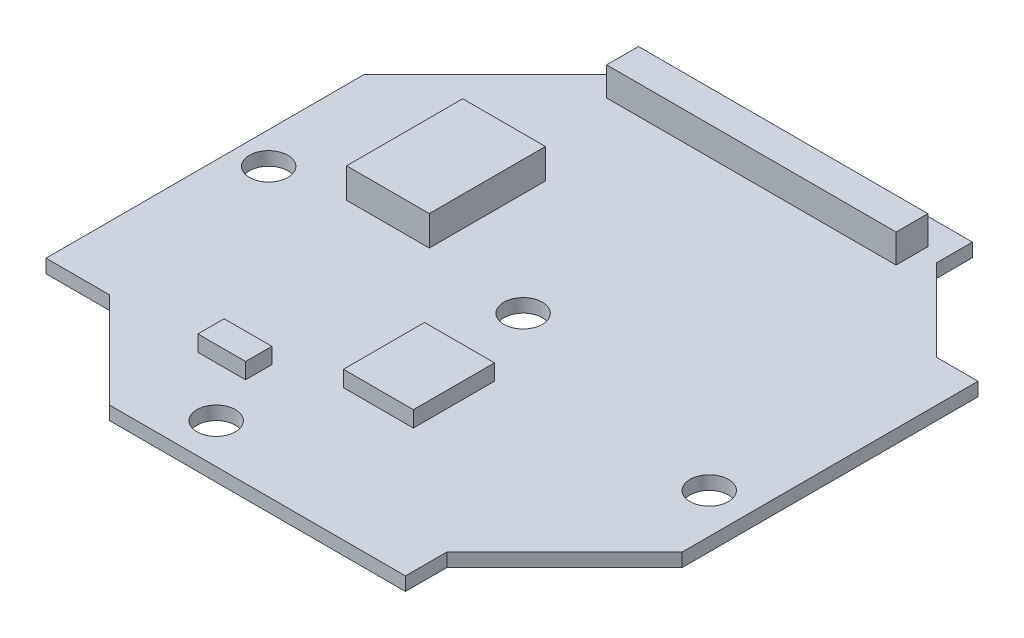
ISO-10303-21;
HEADER;
FILE_DESCRIPTION(('STEP AP214'),'2;1');
FILE_NAME('part.step','',(''),(''),'','','');
FILE_SCHEMA(('AUTOMOTIVE_DESIGN { 1 0 10303 214 1 1 1 1 }'));
ENDSEC;
DATA;
#1=APPLICATION_CONTEXT('core data for automotive mechanical design processes');
#2=APPLICATION_PROTOCOL_DEFINITION('international standard','automotive_design',2000,#1);
#3=PRODUCT_CONTEXT('',#1,'mechanical');
#4=PRODUCT('Part','Part','',(#3));
#5=PRODUCT_RELATED_PRODUCT_CATEGORY('part','',(#4));
#6=PRODUCT_DEFINITION_FORMATION('','',#4);
#7=PRODUCT_DEFINITION_CONTEXT('part definition',#1,'design');
#8=PRODUCT_DEFINITION('design','',#6,#7);
#9=PRODUCT_DEFINITION_SHAPE('','',#8);
#10=(LENGTH_UNIT() NAMED_UNIT(*) SI_UNIT(.MILLI.,.METRE.));
#11=(NAMED_UNIT(*) PLANE_ANGLE_UNIT() SI_UNIT($,.RADIAN.));
#12=(NAMED_UNIT(*) SI_UNIT($,.STERADIAN.) SOLID_ANGLE_UNIT());
#13=UNCERTAINTY_MEASURE_WITH_UNIT(LENGTH_MEASURE(1.E-05),#10,'distance_accuracy_value','');
#14=(GEOMETRIC_REPRESENTATION_CONTEXT(3) GLOBAL_UNCERTAINTY_ASSIGNED_CONTEXT((#13)) GLOBAL_UNIT_ASSIGNED_CONTEXT((#10,
#11,#12)) REPRESENTATION_CONTEXT('',''));
#15=CARTESIAN_POINT('',(0.,0.,0.));
#16=DIRECTION('',(0.,0.,1.));
#17=DIRECTION('',(1.,0.,0.));
#18=AXIS2_PLACEMENT_3D('',#15,#16,#17);
#19=CARTESIAN_POINT('',(-10.25,0.85,-18.));
#20=DIRECTION('',(0.,-1.,0.));
#21=DIRECTION('',(0.,0.,-1.));
#22=AXIS2_PLACEMENT_3D('',#19,#20,#21);
#23=PLANE('',#22);
#24=CARTESIAN_POINT('',(15.5,0.85,3.8));
#25=DIRECTION('',(0.,1.,0.));
#26=DIRECTION('',(0.,0.,1.));
#27=AXIS2_PLACEMENT_3D('',#24,#25,#26);
#28=CIRCLE('',#27,1.21);
#29=CARTESIAN_POINT('',(15.5,0.85,5.01));
#30=VERTEX_POINT('',#29);
#31=EDGE_CURVE('E860',#30,#30,#28,.T.);
#32=ORIENTED_EDGE('',*,*,#31,.F.);
#33=EDGE_LOOP('',(#32));
#34=FACE_BOUND('',#33,.T.);
#35=CARTESIAN_POINT('',(-3.8,0.85,15.5));
#36=DIRECTION('',(0.,1.,0.));
#37=DIRECTION('',(0.,0.,1.));
#38=AXIS2_PLACEMENT_3D('',#35,#36,#37);
#39=CIRCLE('',#38,1.21);
#40=CARTESIAN_POINT('',(-3.8,0.85,16.71));
#41=VERTEX_POINT('',#40);
#42=EDGE_CURVE('E862',#41,#41,#39,.T.);
#43=ORIENTED_EDGE('',*,*,#42,.F.);
#44=EDGE_LOOP('',(#43));
#45=FACE_BOUND('',#44,.T.);
#46=CARTESIAN_POINT('',(-16.,0.85,0.));
#47=DIRECTION('',(0.,1.,0.));
#48=DIRECTION('',(0.,0.,1.));
#49=AXIS2_PLACEMENT_3D('',#46,#47,#48);
#50=CIRCLE('',#49,1.21);
#51=CARTESIAN_POINT('',(-16.,0.85,1.21));
#52=VERTEX_POINT('',#51);
#53=EDGE_CURVE('E868',#52,#52,#50,.T.);
#54=ORIENTED_EDGE('',*,*,#53,.F.);
#55=EDGE_LOOP('',(#54));
#56=FACE_BOUND('',#55,.T.);
#57=CARTESIAN_POINT('',(0.,0.85,0.));
#58=DIRECTION('',(0.,1.,0.));
#59=DIRECTION('',(0.,0.,1.));
#60=AXIS2_PLACEMENT_3D('',#57,#58,#59);
#61=CIRCLE('',#60,1.21);
#62=CARTESIAN_POINT('',(0.,0.85,1.21));
#63=VERTEX_POINT('',#62);
#64=EDGE_CURVE('E874',#63,#63,#61,.T.);
#65=ORIENTED_EDGE('',*,*,#64,.F.);
#66=EDGE_LOOP('',(#65));
#67=FACE_BOUND('',#66,.T.);
#68=DIRECTION('',(0.,0.,1.));
#69=VECTOR('',#68,1.);
#70=CARTESIAN_POINT('',(-1.6,0.85,4.6));
#71=LINE('',#70,#69);
#72=CARTESIAN_POINT('',(-1.6,0.85,4.6));
#73=VERTEX_POINT('',#72);
#74=CARTESIAN_POINT('',(-1.6,0.85,9.7));
#75=VERTEX_POINT('',#74);
#76=EDGE_CURVE('E242',#73,#75,#71,.T.);
#77=ORIENTED_EDGE('',*,*,#76,.F.);
#78=DIRECTION('',(-1.,0.,0.));
#79=VECTOR('',#78,1.);
#80=CARTESIAN_POINT('',(-1.6,0.85,4.6));
#81=LINE('',#80,#79);
#82=CARTESIAN_POINT('',(2.8,0.85,4.6));
#83=VERTEX_POINT('',#82);
#84=EDGE_CURVE('E255',#83,#73,#81,.T.);
#85=ORIENTED_EDGE('',*,*,#84,.F.);
#86=DIRECTION('',(0.,0.,-1.));
#87=VECTOR('',#86,1.);
#88=CARTESIAN_POINT('',(2.8,0.85,4.6));
#89=LINE('',#88,#87);
#90=CARTESIAN_POINT('',(2.8,0.85,9.7));
#91=VERTEX_POINT('',#90);
#92=EDGE_CURVE('E264',#91,#83,#89,.T.);
#93=ORIENTED_EDGE('',*,*,#92,.F.);
#94=DIRECTION('',(1.,0.,0.));
#95=VECTOR('',#94,1.);
#96=CARTESIAN_POINT('',(-1.6,0.85,9.7));
#97=LINE('',#96,#95);
#98=EDGE_CURVE('E245',#75,#91,#97,.T.);
#99=ORIENTED_EDGE('',*,*,#98,.F.);
#100=EDGE_LOOP('',(#77,#85,#93,#99));
#101=FACE_BOUND('',#100,.T.);
#102=DIRECTION('',(0.,0.,1.));
#103=VECTOR('',#102,1.);
#104=CARTESIAN_POINT('',(-9.1,0.85,-16.35));
#105=LINE('',#104,#103);
#106=CARTESIAN_POINT('',(-9.1,0.85,-16.35));
#107=VERTEX_POINT('',#106);
#108=CARTESIAN_POINT('',(-9.1,0.85,-14.35));
#109=VERTEX_POINT('',#108);
#110=EDGE_CURVE('E313',#107,#109,#105,.T.);
#111=ORIENTED_EDGE('',*,*,#110,.F.);
#112=DIRECTION('',(-1.,0.,0.));
#113=VECTOR('',#112,1.);
#114=CARTESIAN_POINT('',(-9.1,0.85,-16.35));
#115=LINE('',#114,#113);
#116=CARTESIAN_POINT('',(9.1,0.85,-16.35));
#117=VERTEX_POINT('',#116);
#118=EDGE_CURVE('E318',#117,#107,#115,.T.);
#119=ORIENTED_EDGE('',*,*,#118,.F.);
#120=DIRECTION('',(0.,0.,-1.));
#121=VECTOR('',#120,1.);
#122=CARTESIAN_POINT('',(9.1,0.85,-16.35));
#123=LINE('',#122,#121);
#124=CARTESIAN_POINT('',(9.1,0.85,-14.35));
#125=VERTEX_POINT('',#124);
#126=EDGE_CURVE('E330',#125,#117,#123,.T.);
#127=ORIENTED_EDGE('',*,*,#126,.F.);
#128=DIRECTION('',(1.,0.,0.));
#129=VECTOR('',#128,1.);
#130=CARTESIAN_POINT('',(-9.1,0.85,-14.35));
#131=LINE('',#130,#129);
#132=EDGE_CURVE('E327',#109,#125,#131,.T.);
#133=ORIENTED_EDGE('',*,*,#132,.F.);
#134=EDGE_LOOP('',(#111,#119,#127,#133));
#135=FACE_BOUND('',#134,.T.);
#136=DIRECTION('',(0.,0.,1.));
#137=VECTOR('',#136,1.);
#138=CARTESIAN_POINT('',(-10.25,0.85,-15.75));
#139=LINE('',#138,#137);
#140=CARTESIAN_POINT('',(-10.25,0.85,-18.));
#141=VERTEX_POINT('',#140);
#142=CARTESIAN_POINT('',(-10.25,0.85,-15.75));
#143=VERTEX_POINT('',#142);
#144=EDGE_CURVE('E347',#141,#143,#139,.T.);
#145=ORIENTED_EDGE('',*,*,#144,.T.);
#146=DIRECTION('',(-0.707106781186546,0.,0.707106781186549));
#147=VECTOR('',#146,1.);
#148=CARTESIAN_POINT('',(-18.,0.85,-7.99999999999997));
#149=LINE('',#148,#147);
#150=CARTESIAN_POINT('',(-18.,0.85,-7.99999999999997));
#151=VERTEX_POINT('',#150);
#152=EDGE_CURVE('E350',#143,#151,#149,.T.);
#153=ORIENTED_EDGE('',*,*,#152,.T.);
#154=DIRECTION('',(0.,0.,1.));
#155=VECTOR('',#154,1.);
#156=CARTESIAN_POINT('',(-18.,0.85,12.));
#157=LINE('',#156,#155);
#158=CARTESIAN_POINT('',(-18.,0.85,12.));
#159=VERTEX_POINT('',#158);
#160=EDGE_CURVE('E353',#151,#159,#157,.T.);
#161=ORIENTED_EDGE('',*,*,#160,.T.);
#162=DIRECTION('',(1.,0.,0.));
#163=VECTOR('',#162,1.);
#164=CARTESIAN_POINT('',(-14.,0.85,12.));
#165=LINE('',#164,#163);
#166=CARTESIAN_POINT('',(-14.,0.85,12.));
#167=VERTEX_POINT('',#166);
#168=EDGE_CURVE('E355',#159,#167,#165,.T.);
#169=ORIENTED_EDGE('',*,*,#168,.T.);
#170=DIRECTION('',(0.707106781186549,0.,0.707106781186546));
#171=VECTOR('',#170,1.);
#172=CARTESIAN_POINT('',(-7.99999999999997,0.85,18.));
#173=LINE('',#172,#171);
#174=CARTESIAN_POINT('',(-7.99999999999997,0.85,18.));
#175=VERTEX_POINT('',#174);
#176=EDGE_CURVE('E357',#167,#175,#173,.T.);
#177=ORIENTED_EDGE('',*,*,#176,.T.);
#178=DIRECTION('',(1.,0.,0.));
#179=VECTOR('',#178,1.);
#180=CARTESIAN_POINT('',(10.6,0.85,18.));
#181=LINE('',#180,#179);
#182=CARTESIAN_POINT('',(10.6,0.85,18.));
#183=VERTEX_POINT('',#182);
#184=EDGE_CURVE('E359',#175,#183,#181,.T.);
#185=ORIENTED_EDGE('',*,*,#184,.T.);
#186=DIRECTION('',(0.,0.,-1.));
#187=VECTOR('',#186,1.);
#188=CARTESIAN_POINT('',(10.6,0.85,15.4));
#189=LINE('',#188,#187);
#190=CARTESIAN_POINT('',(10.6,0.85,15.4));
#191=VERTEX_POINT('',#190);
#192=EDGE_CURVE('E361',#183,#191,#189,.T.);
#193=ORIENTED_EDGE('',*,*,#192,.T.);
#194=DIRECTION('',(0.707106781186546,0.,-0.707106781186549));
#195=VECTOR('',#194,1.);
#196=CARTESIAN_POINT('',(18.,0.85,7.99999999999997));
#197=LINE('',#196,#195);
#198=CARTESIAN_POINT('',(18.,0.85,7.99999999999997));
#199=VERTEX_POINT('',#198);
#200=EDGE_CURVE('E363',#191,#199,#197,.T.);
#201=ORIENTED_EDGE('',*,*,#200,.T.);
#202=DIRECTION('',(0.,0.,-1.));
#203=VECTOR('',#202,1.);
#204=CARTESIAN_POINT('',(18.,0.85,-10.6));
#205=LINE('',#204,#203);
#206=CARTESIAN_POINT('',(18.,0.85,-10.6));
#207=VERTEX_POINT('',#206);
#208=EDGE_CURVE('E365',#199,#207,#205,.T.);
#209=ORIENTED_EDGE('',*,*,#208,.T.);
#210=DIRECTION('',(-1.,0.,0.));
#211=VECTOR('',#210,1.);
#212=CARTESIAN_POINT('',(15.4,0.85,-10.6));
#213=LINE('',#212,#211);
#214=CARTESIAN_POINT('',(15.4,0.85,-10.6));
#215=VERTEX_POINT('',#214);
#216=EDGE_CURVE('E367',#207,#215,#213,.T.);
#217=ORIENTED_EDGE('',*,*,#216,.T.);
#218=DIRECTION('',(-0.707106781186549,0.,-0.707106781186546));
#219=VECTOR('',#218,1.);
#220=CARTESIAN_POINT('',(10.25,0.85,-15.75));
#221=LINE('',#220,#219);
#222=CARTESIAN_POINT('',(10.25,0.85,-15.75));
#223=VERTEX_POINT('',#222);
#224=EDGE_CURVE('E369',#215,#223,#221,.T.);
#225=ORIENTED_EDGE('',*,*,#224,.T.);
#226=DIRECTION('',(0.,0.,-1.));
#227=VECTOR('',#226,1.);
#228=CARTESIAN_POINT('',(10.25,0.85,-18.));
#229=LINE('',#228,#227);
#230=CARTESIAN_POINT('',(10.25,0.85,-18.));
#231=VERTEX_POINT('',#230);
#232=EDGE_CURVE('E371',#223,#231,#229,.T.);
#233=ORIENTED_EDGE('',*,*,#232,.T.);
#234=DIRECTION('',(-1.,0.,0.));
#235=VECTOR('',#234,1.);
#236=CARTESIAN_POINT('',(-10.25,0.85,-18.));
#237=LINE('',#236,#235);
#238=EDGE_CURVE('E373',#231,#141,#237,.T.);
#239=ORIENTED_EDGE('',*,*,#238,.T.);
#240=EDGE_LOOP('',(#145,#153,#161,#169,#177,#185,#193,#201,#209,#217,#225,#233,#239));
#241=FACE_BOUND('',#240,.T.);
#242=DIRECTION('',(0.,0.,1.));
#243=VECTOR('',#242,1.);
#244=CARTESIAN_POINT('',(-11.7,0.85,-7.9));
#245=LINE('',#244,#243);
#246=CARTESIAN_POINT('',(-11.7,0.85,-7.9));
#247=VERTEX_POINT('',#246);
#248=CARTESIAN_POINT('',(-11.7,0.85,-0.6));
#249=VERTEX_POINT('',#248);
#250=EDGE_CURVE('E280',#247,#249,#245,.T.);
#251=ORIENTED_EDGE('',*,*,#250,.F.);
#252=DIRECTION('',(-1.,0.,0.));
#253=VECTOR('',#252,1.);
#254=CARTESIAN_POINT('',(-11.7,0.85,-7.9));
#255=LINE('',#254,#253);
#256=CARTESIAN_POINT('',(-6.5,0.85,-7.9));
#257=VERTEX_POINT('',#256);
#258=EDGE_CURVE('E285',#257,#247,#255,.T.);
#259=ORIENTED_EDGE('',*,*,#258,.F.);
#260=DIRECTION('',(0.,0.,-1.));
#261=VECTOR('',#260,1.);
#262=CARTESIAN_POINT('',(-6.5,0.85,-7.9));
#263=LINE('',#262,#261);
#264=CARTESIAN_POINT('',(-6.5,0.85,-0.6));
#265=VERTEX_POINT('',#264);
#266=EDGE_CURVE('E297',#265,#257,#263,.T.);
#267=ORIENTED_EDGE('',*,*,#266,.F.);
#268=DIRECTION('',(1.,0.,0.));
#269=VECTOR('',#268,1.);
#270=CARTESIAN_POINT('',(-11.7,0.85,-0.6));
#271=LINE('',#270,#269);
#272=EDGE_CURVE('E294',#249,#265,#271,.T.);
#273=ORIENTED_EDGE('',*,*,#272,.F.);
#274=EDGE_LOOP('',(#251,#259,#267,#273));
#275=FACE_BOUND('',#274,.T.);
#276=DIRECTION('',(0.,0.,-1.));
#277=VECTOR('',#276,1.);
#278=CARTESIAN_POINT('',(-5.1,0.85,12.35));
#279=LINE('',#278,#277);
#280=CARTESIAN_POINT('',(-5.1,0.85,12.35));
#281=VERTEX_POINT('',#280);
#282=CARTESIAN_POINT('',(-5.1,0.85,10.7));
#283=VERTEX_POINT('',#282);
#284=EDGE_CURVE('E241',#281,#283,#279,.T.);
#285=ORIENTED_EDGE('',*,*,#284,.F.);
#286=DIRECTION('',(1.,0.,0.));
#287=VECTOR('',#286,1.);
#288=CARTESIAN_POINT('',(-5.1,0.85,12.35));
#289=LINE('',#288,#287);
#290=CARTESIAN_POINT('',(-8.1,0.85,12.35));
#291=VERTEX_POINT('',#290);
#292=EDGE_CURVE('E238',#291,#281,#289,.T.);
#293=ORIENTED_EDGE('',*,*,#292,.F.);
#294=DIRECTION('',(0.,0.,1.));
#295=VECTOR('',#294,1.);
#296=CARTESIAN_POINT('',(-8.1,0.85,12.35));
#297=LINE('',#296,#295);
#298=CARTESIAN_POINT('',(-8.1,0.85,10.7));
#299=VERTEX_POINT('',#298);
#300=EDGE_CURVE('E50',#299,#291,#297,.T.);
#301=ORIENTED_EDGE('',*,*,#300,.F.);
#302=DIRECTION('',(-1.,0.,0.));
#303=VECTOR('',#302,1.);
#304=CARTESIAN_POINT('',(-5.1,0.85,10.7));
#305=LINE('',#304,#303);
#306=EDGE_CURVE('E45',#283,#299,#305,.T.);
#307=ORIENTED_EDGE('',*,*,#306,.F.);
#308=EDGE_LOOP('',(#285,#293,#301,#307));
#309=FACE_BOUND('',#308,.T.);
#310=ADVANCED_FACE('F30',(#34,#45,#56,#67,#101,#135,#241,#275,#309),#23,.F.);
#311=CARTESIAN_POINT('',(-10.25,0.85,-15.75));
#312=DIRECTION('',(1.,0.,0.));
#313=DIRECTION('',(0.,0.,-1.));
#314=AXIS2_PLACEMENT_3D('',#311,#312,#313);
#315=PLANE('',#314);
#316=DIRECTION('',(0.,0.,1.));
#317=VECTOR('',#316,1.);
#318=CARTESIAN_POINT('',(-10.25,0.,-15.75));
#319=LINE('',#318,#317);
#320=CARTESIAN_POINT('',(-10.25,0.,-18.));
#321=VERTEX_POINT('',#320);
#322=CARTESIAN_POINT('',(-10.25,0.,-15.75));
#323=VERTEX_POINT('',#322);
#324=EDGE_CURVE('E346',#321,#323,#319,.T.);
#325=ORIENTED_EDGE('',*,*,#324,.T.);
#326=DIRECTION('',(0.,-1.,0.));
#327=VECTOR('',#326,1.);
#328=CARTESIAN_POINT('',(-10.25,0.85,-15.75));
#329=LINE('',#328,#327);
#330=EDGE_CURVE('E11',#143,#323,#329,.T.);
#331=ORIENTED_EDGE('',*,*,#330,.F.);
#332=ORIENTED_EDGE('',*,*,#144,.F.);
#333=DIRECTION('',(0.,-1.,0.));
#334=VECTOR('',#333,1.);
#335=CARTESIAN_POINT('',(-10.25,0.85,-18.));
#336=LINE('',#335,#334);
#337=EDGE_CURVE('E375',#141,#321,#336,.T.);
#338=ORIENTED_EDGE('',*,*,#337,.T.);
#339=EDGE_LOOP('',(#325,#331,#332,#338));
#340=FACE_BOUND('',#339,.T.);
#341=ADVANCED_FACE('F32',(#340),#315,.F.);
#342=CARTESIAN_POINT('',(-18.,0.85,-7.99999999999997));
#343=DIRECTION('',(0.707106781186549,0.,0.707106781186546));
#344=DIRECTION('',(0.707106781186546,0.,-0.707106781186549));
#345=AXIS2_PLACEMENT_3D('',#342,#343,#344);
#346=PLANE('',#345);
#347=DIRECTION('',(-0.707106781186546,0.,0.707106781186549));
#348=VECTOR('',#347,1.);
#349=CARTESIAN_POINT('',(-18.,0.,-7.99999999999997));
#350=LINE('',#349,#348);
#351=CARTESIAN_POINT('',(-18.,0.,-7.99999999999997));
#352=VERTEX_POINT('',#351);
#353=EDGE_CURVE('E378',#323,#352,#350,.T.);
#354=ORIENTED_EDGE('',*,*,#353,.T.);
#355=DIRECTION('',(0.,-1.,0.));
#356=VECTOR('',#355,1.);
#357=CARTESIAN_POINT('',(-18.,0.85,-7.99999999999997));
#358=LINE('',#357,#356);
#359=EDGE_CURVE('E38',#151,#352,#358,.T.);
#360=ORIENTED_EDGE('',*,*,#359,.F.);
#361=ORIENTED_EDGE('',*,*,#152,.F.);
#362=ORIENTED_EDGE('',*,*,#330,.T.);
#363=EDGE_LOOP('',(#354,#360,#361,#362));
#364=FACE_BOUND('',#363,.T.);
#365=ADVANCED_FACE('F460',(#364),#346,.F.);
#366=CARTESIAN_POINT('',(-18.,0.85,12.));
#367=DIRECTION('',(1.,0.,0.));
#368=DIRECTION('',(0.,0.,-1.));
#369=AXIS2_PLACEMENT_3D('',#366,#367,#368);
#370=PLANE('',#369);
#371=DIRECTION('',(0.,0.,1.));
#372=VECTOR('',#371,1.);
#373=CARTESIAN_POINT('',(-18.,0.,12.));
#374=LINE('',#373,#372);
#375=CARTESIAN_POINT('',(-18.,0.,12.));
#376=VERTEX_POINT('',#375);
#377=EDGE_CURVE('E380',#352,#376,#374,.T.);
#378=ORIENTED_EDGE('',*,*,#377,.T.);
#379=DIRECTION('',(0.,-1.,0.));
#380=VECTOR('',#379,1.);
#381=CARTESIAN_POINT('',(-18.,0.85,12.));
#382=LINE('',#381,#380);
#383=EDGE_CURVE('E430',#159,#376,#382,.T.);
#384=ORIENTED_EDGE('',*,*,#383,.F.);
#385=ORIENTED_EDGE('',*,*,#160,.F.);
#386=ORIENTED_EDGE('',*,*,#359,.T.);
#387=EDGE_LOOP('',(#378,#384,#385,#386));
#388=FACE_BOUND('',#387,.T.);
#389=ADVANCED_FACE('F437',(#388),#370,.F.);
#390=CARTESIAN_POINT('',(-14.,0.85,12.));
#391=DIRECTION('',(0.,0.,-1.));
#392=DIRECTION('',(-1.,0.,0.));
#393=AXIS2_PLACEMENT_3D('',#390,#391,#392);
#394=PLANE('',#393);
#395=DIRECTION('',(1.,0.,0.));
#396=VECTOR('',#395,1.);
#397=CARTESIAN_POINT('',(-14.,0.,12.));
#398=LINE('',#397,#396);
#399=CARTESIAN_POINT('',(-14.,0.,12.));
#400=VERTEX_POINT('',#399);
#401=EDGE_CURVE('E382',#376,#400,#398,.T.);
#402=ORIENTED_EDGE('',*,*,#401,.T.);
#403=DIRECTION('',(0.,-1.,0.));
#404=VECTOR('',#403,1.);
#405=CARTESIAN_POINT('',(-14.,0.85,12.));
#406=LINE('',#405,#404);
#407=EDGE_CURVE('E427',#167,#400,#406,.T.);
#408=ORIENTED_EDGE('',*,*,#407,.F.);
#409=ORIENTED_EDGE('',*,*,#168,.F.);
#410=ORIENTED_EDGE('',*,*,#383,.T.);
#411=EDGE_LOOP('',(#402,#408,#409,#410));
#412=FACE_BOUND('',#411,.T.);
#413=ADVANCED_FACE('F448',(#412),#394,.F.);
#414=CARTESIAN_POINT('',(-7.99999999999997,0.85,18.));
#415=DIRECTION('',(0.707106781186546,0.,-0.707106781186549));
#416=DIRECTION('',(-0.707106781186549,0.,-0.707106781186546));
#417=AXIS2_PLACEMENT_3D('',#414,#415,#416);
#418=PLANE('',#417);
#419=DIRECTION('',(0.707106781186549,0.,0.707106781186546));
#420=VECTOR('',#419,1.);
#421=CARTESIAN_POINT('',(-7.99999999999997,0.,18.));
#422=LINE('',#421,#420);
#423=CARTESIAN_POINT('',(-7.99999999999997,0.,18.));
#424=VERTEX_POINT('',#423);
#425=EDGE_CURVE('E384',#400,#424,#422,.T.);
#426=ORIENTED_EDGE('',*,*,#425,.T.);
#427=DIRECTION('',(0.,-1.,0.));
#428=VECTOR('',#427,1.);
#429=CARTESIAN_POINT('',(-7.99999999999997,0.85,18.));
#430=LINE('',#429,#428);
#431=EDGE_CURVE('E424',#175,#424,#430,.T.);
#432=ORIENTED_EDGE('',*,*,#431,.F.);
#433=ORIENTED_EDGE('',*,*,#176,.F.);
#434=ORIENTED_EDGE('',*,*,#407,.T.);
#435=EDGE_LOOP('',(#426,#432,#433,#434));
#436=FACE_BOUND('',#435,.T.);
#437=ADVANCED_FACE('F452',(#436),#418,.F.);
#438=CARTESIAN_POINT('',(10.6,0.85,18.));
#439=DIRECTION('',(0.,0.,-1.));
#440=DIRECTION('',(-1.,0.,0.));
#441=AXIS2_PLACEMENT_3D('',#438,#439,#440);
#442=PLANE('',#441);
#443=DIRECTION('',(1.,0.,0.));
#444=VECTOR('',#443,1.);
#445=CARTESIAN_POINT('',(10.6,0.,18.));
#446=LINE('',#445,#444);
#447=CARTESIAN_POINT('',(10.6,0.,18.));
#448=VERTEX_POINT('',#447);
#449=EDGE_CURVE('E386',#424,#448,#446,.T.);
#450=ORIENTED_EDGE('',*,*,#449,.T.);
#451=DIRECTION('',(0.,-1.,0.));
#452=VECTOR('',#451,1.);
#453=CARTESIAN_POINT('',(10.6,0.85,18.));
#454=LINE('',#453,#452);
#455=EDGE_CURVE('E421',#183,#448,#454,.T.);
#456=ORIENTED_EDGE('',*,*,#455,.F.);
#457=ORIENTED_EDGE('',*,*,#184,.F.);
#458=ORIENTED_EDGE('',*,*,#431,.T.);
#459=EDGE_LOOP('',(#450,#456,#457,#458));
#460=FACE_BOUND('',#459,.T.);
#461=ADVANCED_FACE('F498',(#460),#442,.F.);
#462=CARTESIAN_POINT('',(10.6,0.85,15.4));
#463=DIRECTION('',(-1.,0.,0.));
#464=DIRECTION('',(0.,0.,1.));
#465=AXIS2_PLACEMENT_3D('',#462,#463,#464);
#466=PLANE('',#465);
#467=DIRECTION('',(0.,0.,-1.));
#468=VECTOR('',#467,1.);
#469=CARTESIAN_POINT('',(10.6,0.,15.4));
#470=LINE('',#469,#468);
#471=CARTESIAN_POINT('',(10.6,0.,15.4));
#472=VERTEX_POINT('',#471);
#473=EDGE_CURVE('E388',#448,#472,#470,.T.);
#474=ORIENTED_EDGE('',*,*,#473,.T.);
#475=DIRECTION('',(0.,-1.,0.));
#476=VECTOR('',#475,1.);
#477=CARTESIAN_POINT('',(10.6,0.85,15.4));
#478=LINE('',#477,#476);
#479=EDGE_CURVE('E418',#191,#472,#478,.T.);
#480=ORIENTED_EDGE('',*,*,#479,.F.);
#481=ORIENTED_EDGE('',*,*,#192,.F.);
#482=ORIENTED_EDGE('',*,*,#455,.T.);
#483=EDGE_LOOP('',(#474,#480,#481,#482));
#484=FACE_BOUND('',#483,.T.);
#485=ADVANCED_FACE('F495',(#484),#466,.F.);
#486=CARTESIAN_POINT('',(18.,0.85,7.99999999999997));
#487=DIRECTION('',(-0.707106781186549,0.,-0.707106781186546));
#488=DIRECTION('',(-0.707106781186546,0.,0.707106781186549));
#489=AXIS2_PLACEMENT_3D('',#486,#487,#488);
#490=PLANE('',#489);
#491=DIRECTION('',(0.707106781186546,0.,-0.707106781186549));
#492=VECTOR('',#491,1.);
#493=CARTESIAN_POINT('',(18.,0.,7.99999999999997));
#494=LINE('',#493,#492);
#495=CARTESIAN_POINT('',(18.,0.,7.99999999999997));
#496=VERTEX_POINT('',#495);
#497=EDGE_CURVE('E390',#472,#496,#494,.T.);
#498=ORIENTED_EDGE('',*,*,#497,.T.);
#499=DIRECTION('',(0.,-1.,0.));
#500=VECTOR('',#499,1.);
#501=CARTESIAN_POINT('',(18.,0.85,7.99999999999997));
#502=LINE('',#501,#500);
#503=EDGE_CURVE('E415',#199,#496,#502,.T.);
#504=ORIENTED_EDGE('',*,*,#503,.F.);
#505=ORIENTED_EDGE('',*,*,#200,.F.);
#506=ORIENTED_EDGE('',*,*,#479,.T.);
#507=EDGE_LOOP('',(#498,#504,#505,#506));
#508=FACE_BOUND('',#507,.T.);
#509=ADVANCED_FACE('F491',(#508),#490,.F.);
#510=CARTESIAN_POINT('',(18.,0.85,-10.6));
#511=DIRECTION('',(-1.,0.,0.));
#512=DIRECTION('',(0.,0.,1.));
#513=AXIS2_PLACEMENT_3D('',#510,#511,#512);
#514=PLANE('',#513);
#515=DIRECTION('',(0.,0.,-1.));
#516=VECTOR('',#515,1.);
#517=CARTESIAN_POINT('',(18.,0.,-10.6));
#518=LINE('',#517,#516);
#519=CARTESIAN_POINT('',(18.,0.,-10.6));
#520=VERTEX_POINT('',#519);
#521=EDGE_CURVE('E392',#496,#520,#518,.T.);
#522=ORIENTED_EDGE('',*,*,#521,.T.);
#523=DIRECTION('',(0.,-1.,0.));
#524=VECTOR('',#523,1.);
#525=CARTESIAN_POINT('',(18.,0.85,-10.6));
#526=LINE('',#525,#524);
#527=EDGE_CURVE('E412',#207,#520,#526,.T.);
#528=ORIENTED_EDGE('',*,*,#527,.F.);
#529=ORIENTED_EDGE('',*,*,#208,.F.);
#530=ORIENTED_EDGE('',*,*,#503,.T.);
#531=EDGE_LOOP('',(#522,#528,#529,#530));
#532=FACE_BOUND('',#531,.T.);
#533=ADVANCED_FACE('F487',(#532),#514,.F.);
#534=CARTESIAN_POINT('',(15.4,0.85,-10.6));
#535=DIRECTION('',(0.,0.,1.));
#536=DIRECTION('',(1.,0.,0.));
#537=AXIS2_PLACEMENT_3D('',#534,#535,#536);
#538=PLANE('',#537);
#539=DIRECTION('',(-1.,0.,0.));
#540=VECTOR('',#539,1.);
#541=CARTESIAN_POINT('',(15.4,0.,-10.6));
#542=LINE('',#541,#540);
#543=CARTESIAN_POINT('',(15.4,0.,-10.6));
#544=VERTEX_POINT('',#543);
#545=EDGE_CURVE('E394',#520,#544,#542,.T.);
#546=ORIENTED_EDGE('',*,*,#545,.T.);
#547=DIRECTION('',(0.,-1.,0.));
#548=VECTOR('',#547,1.);
#549=CARTESIAN_POINT('',(15.4,0.85,-10.6));
#550=LINE('',#549,#548);
#551=EDGE_CURVE('E409',#215,#544,#550,.T.);
#552=ORIENTED_EDGE('',*,*,#551,.F.);
#553=ORIENTED_EDGE('',*,*,#216,.F.);
#554=ORIENTED_EDGE('',*,*,#527,.T.);
#555=EDGE_LOOP('',(#546,#552,#553,#554));
#556=FACE_BOUND('',#555,.T.);
#557=ADVANCED_FACE('F482',(#556),#538,.F.);
#558=CARTESIAN_POINT('',(10.25,0.85,-15.75));
#559=DIRECTION('',(-0.707106781186546,0.,0.707106781186549));
#560=DIRECTION('',(0.707106781186549,0.,0.707106781186546));
#561=AXIS2_PLACEMENT_3D('',#558,#559,#560);
#562=PLANE('',#561);
#563=DIRECTION('',(-0.707106781186549,0.,-0.707106781186546));
#564=VECTOR('',#563,1.);
#565=CARTESIAN_POINT('',(10.25,0.,-15.75));
#566=LINE('',#565,#564);
#567=CARTESIAN_POINT('',(10.25,0.,-15.75));
#568=VERTEX_POINT('',#567);
#569=EDGE_CURVE('E396',#544,#568,#566,.T.);
#570=ORIENTED_EDGE('',*,*,#569,.T.);
#571=DIRECTION('',(0.,-1.,0.));
#572=VECTOR('',#571,1.);
#573=CARTESIAN_POINT('',(10.25,0.85,-15.75));
#574=LINE('',#573,#572);
#575=EDGE_CURVE('E406',#223,#568,#574,.T.);
#576=ORIENTED_EDGE('',*,*,#575,.F.);
#577=ORIENTED_EDGE('',*,*,#224,.F.);
#578=ORIENTED_EDGE('',*,*,#551,.T.);
#579=EDGE_LOOP('',(#570,#576,#577,#578));
#580=FACE_BOUND('',#579,.T.);
#581=ADVANCED_FACE('F476',(#580),#562,.F.);
#582=CARTESIAN_POINT('',(10.25,0.85,-18.));
#583=DIRECTION('',(-1.,0.,0.));
#584=DIRECTION('',(0.,0.,1.));
#585=AXIS2_PLACEMENT_3D('',#582,#583,#584);
#586=PLANE('',#585);
#587=DIRECTION('',(0.,0.,-1.));
#588=VECTOR('',#587,1.);
#589=CARTESIAN_POINT('',(10.25,0.,-18.));
#590=LINE('',#589,#588);
#591=CARTESIAN_POINT('',(10.25,0.,-18.));
#592=VERTEX_POINT('',#591);
#593=EDGE_CURVE('E398',#568,#592,#590,.T.);
#594=ORIENTED_EDGE('',*,*,#593,.T.);
#595=DIRECTION('',(0.,-1.,0.));
#596=VECTOR('',#595,1.);
#597=CARTESIAN_POINT('',(10.25,0.85,-18.));
#598=LINE('',#597,#596);
#599=EDGE_CURVE('E403',#231,#592,#598,.T.);
#600=ORIENTED_EDGE('',*,*,#599,.F.);
#601=ORIENTED_EDGE('',*,*,#232,.F.);
#602=ORIENTED_EDGE('',*,*,#575,.T.);
#603=EDGE_LOOP('',(#594,#600,#601,#602));
#604=FACE_BOUND('',#603,.T.);
#605=ADVANCED_FACE('F472',(#604),#586,.F.);
#606=CARTESIAN_POINT('',(-10.25,0.85,-18.));
#607=DIRECTION('',(0.,0.,1.));
#608=DIRECTION('',(1.,0.,0.));
#609=AXIS2_PLACEMENT_3D('',#606,#607,#608);
#610=PLANE('',#609);
#611=DIRECTION('',(-1.,0.,0.));
#612=VECTOR('',#611,1.);
#613=CARTESIAN_POINT('',(-10.25,0.,-18.));
#614=LINE('',#613,#612);
#615=EDGE_CURVE('E351',#592,#321,#614,.T.);
#616=ORIENTED_EDGE('',*,*,#615,.T.);
#617=ORIENTED_EDGE('',*,*,#337,.F.);
#618=ORIENTED_EDGE('',*,*,#238,.F.);
#619=ORIENTED_EDGE('',*,*,#599,.T.);
#620=EDGE_LOOP('',(#616,#617,#618,#619));
#621=FACE_BOUND('',#620,.T.);
#622=ADVANCED_FACE('F467',(#621),#610,.F.);
#623=CARTESIAN_POINT('',(-10.25,0.,-18.));
#624=DIRECTION('',(0.,-1.,0.));
#625=DIRECTION('',(0.,0.,-1.));
#626=AXIS2_PLACEMENT_3D('',#623,#624,#625);
#627=PLANE('',#626);
#628=CARTESIAN_POINT('',(15.5,0.,3.8));
#629=DIRECTION('',(0.,1.,0.));
#630=DIRECTION('',(0.,0.,1.));
#631=AXIS2_PLACEMENT_3D('',#628,#629,#630);
#632=CIRCLE('',#631,1.21);
#633=CARTESIAN_POINT('',(15.5,0.,5.01));
#634=VERTEX_POINT('',#633);
#635=EDGE_CURVE('E858',#634,#634,#632,.T.);
#636=ORIENTED_EDGE('',*,*,#635,.T.);
#637=EDGE_LOOP('',(#636));
#638=FACE_BOUND('',#637,.T.);
#639=CARTESIAN_POINT('',(-3.8,0.,15.5));
#640=DIRECTION('',(0.,1.,0.));
#641=DIRECTION('',(0.,0.,1.));
#642=AXIS2_PLACEMENT_3D('',#639,#640,#641);
#643=CIRCLE('',#642,1.21);
#644=CARTESIAN_POINT('',(-3.8,0.,16.71));
#645=VERTEX_POINT('',#644);
#646=EDGE_CURVE('E865',#645,#645,#643,.T.);
#647=ORIENTED_EDGE('',*,*,#646,.T.);
#648=EDGE_LOOP('',(#647));
#649=FACE_BOUND('',#648,.T.);
#650=CARTESIAN_POINT('',(-16.,0.,0.));
#651=DIRECTION('',(0.,1.,0.));
#652=DIRECTION('',(0.,0.,1.));
#653=AXIS2_PLACEMENT_3D('',#650,#651,#652);
#654=CIRCLE('',#653,1.21);
#655=CARTESIAN_POINT('',(-16.,0.,1.21));
#656=VERTEX_POINT('',#655);
#657=EDGE_CURVE('E871',#656,#656,#654,.T.);
#658=ORIENTED_EDGE('',*,*,#657,.T.);
#659=EDGE_LOOP('',(#658));
#660=FACE_BOUND('',#659,.T.);
#661=CARTESIAN_POINT('',(0.,0.,0.));
#662=DIRECTION('',(0.,1.,0.));
#663=DIRECTION('',(0.,0.,1.));
#664=AXIS2_PLACEMENT_3D('',#661,#662,#663);
#665=CIRCLE('',#664,1.21);
#666=CARTESIAN_POINT('',(0.,0.,1.21));
#667=VERTEX_POINT('',#666);
#668=EDGE_CURVE('E877',#667,#667,#665,.T.);
#669=ORIENTED_EDGE('',*,*,#668,.T.);
#670=EDGE_LOOP('',(#669));
#671=FACE_BOUND('',#670,.T.);
#672=ORIENTED_EDGE('',*,*,#324,.F.);
#673=ORIENTED_EDGE('',*,*,#615,.F.);
#674=ORIENTED_EDGE('',*,*,#593,.F.);
#675=ORIENTED_EDGE('',*,*,#569,.F.);
#676=ORIENTED_EDGE('',*,*,#545,.F.);
#677=ORIENTED_EDGE('',*,*,#521,.F.);
#678=ORIENTED_EDGE('',*,*,#497,.F.);
#679=ORIENTED_EDGE('',*,*,#473,.F.);
#680=ORIENTED_EDGE('',*,*,#449,.F.);
#681=ORIENTED_EDGE('',*,*,#425,.F.);
#682=ORIENTED_EDGE('',*,*,#401,.F.);
#683=ORIENTED_EDGE('',*,*,#377,.F.);
#684=ORIENTED_EDGE('',*,*,#353,.F.);
#685=EDGE_LOOP('',(#672,#673,#674,#675,#676,#677,#678,#679,#680,#681,#682,#683,#684));
#686=FACE_BOUND('',#685,.T.);
#687=ADVANCED_FACE('F443',(#638,#649,#660,#671,#686),#627,.T.);
#688=CARTESIAN_POINT('',(-9.1,2.65,-16.35));
#689=DIRECTION('',(1.,0.,0.));
#690=DIRECTION('',(0.,0.,-1.));
#691=AXIS2_PLACEMENT_3D('',#688,#689,#690);
#692=PLANE('',#691);
#693=ORIENTED_EDGE('',*,*,#110,.T.);
#694=DIRECTION('',(0.,-1.,0.));
#695=VECTOR('',#694,1.);
#696=CARTESIAN_POINT('',(-9.1,2.65,-14.35));
#697=LINE('',#696,#695);
#698=CARTESIAN_POINT('',(-9.1,2.65,-14.35));
#699=VERTEX_POINT('',#698);
#700=EDGE_CURVE('E343',#699,#109,#697,.T.);
#701=ORIENTED_EDGE('',*,*,#700,.F.);
#702=DIRECTION('',(0.,0.,1.));
#703=VECTOR('',#702,1.);
#704=CARTESIAN_POINT('',(-9.1,2.65,-16.35));
#705=LINE('',#704,#703);
#706=CARTESIAN_POINT('',(-9.1,2.65,-16.35));
#707=VERTEX_POINT('',#706);
#708=EDGE_CURVE('E314',#707,#699,#705,.T.);
#709=ORIENTED_EDGE('',*,*,#708,.F.);
#710=DIRECTION('',(0.,-1.,0.));
#711=VECTOR('',#710,1.);
#712=CARTESIAN_POINT('',(-9.1,2.65,-16.35));
#713=LINE('',#712,#711);
#714=EDGE_CURVE('E324',#707,#107,#713,.T.);
#715=ORIENTED_EDGE('',*,*,#714,.T.);
#716=EDGE_LOOP('',(#693,#701,#709,#715));
#717=FACE_BOUND('',#716,.T.);
#718=ADVANCED_FACE('F517',(#717),#692,.F.);
#719=CARTESIAN_POINT('',(-9.1,2.65,-14.35));
#720=DIRECTION('',(0.,0.,-1.));
#721=DIRECTION('',(-1.,0.,0.));
#722=AXIS2_PLACEMENT_3D('',#719,#720,#721);
#723=PLANE('',#722);
#724=ORIENTED_EDGE('',*,*,#132,.T.);
#725=DIRECTION('',(0.,-1.,0.));
#726=VECTOR('',#725,1.);
#727=CARTESIAN_POINT('',(9.1,2.65,-14.35));
#728=LINE('',#727,#726);
#729=CARTESIAN_POINT('',(9.1,2.65,-14.35));
#730=VERTEX_POINT('',#729);
#731=EDGE_CURVE('E340',#730,#125,#728,.T.);
#732=ORIENTED_EDGE('',*,*,#731,.F.);
#733=DIRECTION('',(1.,0.,0.));
#734=VECTOR('',#733,1.);
#735=CARTESIAN_POINT('',(-9.1,2.65,-14.35));
#736=LINE('',#735,#734);
#737=EDGE_CURVE('E317',#699,#730,#736,.T.);
#738=ORIENTED_EDGE('',*,*,#737,.F.);
#739=ORIENTED_EDGE('',*,*,#700,.T.);
#740=EDGE_LOOP('',(#724,#732,#738,#739));
#741=FACE_BOUND('',#740,.T.);
#742=ADVANCED_FACE('F568',(#741),#723,.F.);
#743=CARTESIAN_POINT('',(9.1,2.65,-16.35));
#744=DIRECTION('',(-1.,0.,0.));
#745=DIRECTION('',(0.,0.,1.));
#746=AXIS2_PLACEMENT_3D('',#743,#744,#745);
#747=PLANE('',#746);
#748=ORIENTED_EDGE('',*,*,#126,.T.);
#749=DIRECTION('',(0.,-1.,0.));
#750=VECTOR('',#749,1.);
#751=CARTESIAN_POINT('',(9.1,2.65,-16.35));
#752=LINE('',#751,#750);
#753=CARTESIAN_POINT('',(9.1,2.65,-16.35));
#754=VERTEX_POINT('',#753);
#755=EDGE_CURVE('E337',#754,#117,#752,.T.);
#756=ORIENTED_EDGE('',*,*,#755,.F.);
#757=DIRECTION('',(0.,0.,-1.));
#758=VECTOR('',#757,1.);
#759=CARTESIAN_POINT('',(9.1,2.65,-16.35));
#760=LINE('',#759,#758);
#761=EDGE_CURVE('E320',#730,#754,#760,.T.);
#762=ORIENTED_EDGE('',*,*,#761,.F.);
#763=ORIENTED_EDGE('',*,*,#731,.T.);
#764=EDGE_LOOP('',(#748,#756,#762,#763));
#765=FACE_BOUND('',#764,.T.);
#766=ADVANCED_FACE('F575',(#765),#747,.F.);
#767=CARTESIAN_POINT('',(-9.1,2.65,-16.35));
#768=DIRECTION('',(0.,0.,1.));
#769=DIRECTION('',(1.,0.,0.));
#770=AXIS2_PLACEMENT_3D('',#767,#768,#769);
#771=PLANE('',#770);
#772=ORIENTED_EDGE('',*,*,#118,.T.);
#773=ORIENTED_EDGE('',*,*,#714,.F.);
#774=DIRECTION('',(-1.,0.,0.));
#775=VECTOR('',#774,1.);
#776=CARTESIAN_POINT('',(-9.1,2.65,-16.35));
#777=LINE('',#776,#775);
#778=EDGE_CURVE('E322',#754,#707,#777,.T.);
#779=ORIENTED_EDGE('',*,*,#778,.F.);
#780=ORIENTED_EDGE('',*,*,#755,.T.);
#781=EDGE_LOOP('',(#772,#773,#779,#780));
#782=FACE_BOUND('',#781,.T.);
#783=ADVANCED_FACE('F582',(#782),#771,.F.);
#784=CARTESIAN_POINT('',(-9.1,2.65,-14.35));
#785=DIRECTION('',(0.,1.,0.));
#786=DIRECTION('',(0.,0.,1.));
#787=AXIS2_PLACEMENT_3D('',#784,#785,#786);
#788=PLANE('',#787);
#789=ORIENTED_EDGE('',*,*,#708,.T.);
#790=ORIENTED_EDGE('',*,*,#737,.T.);
#791=ORIENTED_EDGE('',*,*,#761,.T.);
#792=ORIENTED_EDGE('',*,*,#778,.T.);
#793=EDGE_LOOP('',(#789,#790,#791,#792));
#794=FACE_BOUND('',#793,.T.);
#795=ADVANCED_FACE('F590',(#794),#788,.T.);
#796=CARTESIAN_POINT('',(-11.7,2.73,-7.9));
#797=DIRECTION('',(1.,0.,0.));
#798=DIRECTION('',(0.,0.,-1.));
#799=AXIS2_PLACEMENT_3D('',#796,#797,#798);
#800=PLANE('',#799);
#801=ORIENTED_EDGE('',*,*,#250,.T.);
#802=DIRECTION('',(0.,-1.,0.));
#803=VECTOR('',#802,1.);
#804=CARTESIAN_POINT('',(-11.7,2.73,-0.6));
#805=LINE('',#804,#803);
#806=CARTESIAN_POINT('',(-11.7,2.73,-0.6));
#807=VERTEX_POINT('',#806);
#808=EDGE_CURVE('E310',#807,#249,#805,.T.);
#809=ORIENTED_EDGE('',*,*,#808,.F.);
#810=DIRECTION('',(0.,0.,1.));
#811=VECTOR('',#810,1.);
#812=CARTESIAN_POINT('',(-11.7,2.73,-7.9));
#813=LINE('',#812,#811);
#814=CARTESIAN_POINT('',(-11.7,2.73,-7.9));
#815=VERTEX_POINT('',#814);
#816=EDGE_CURVE('E281',#815,#807,#813,.T.);
#817=ORIENTED_EDGE('',*,*,#816,.F.);
#818=DIRECTION('',(0.,-1.,0.));
#819=VECTOR('',#818,1.);
#820=CARTESIAN_POINT('',(-11.7,2.73,-7.9));
#821=LINE('',#820,#819);
#822=EDGE_CURVE('E291',#815,#247,#821,.T.);
#823=ORIENTED_EDGE('',*,*,#822,.T.);
#824=EDGE_LOOP('',(#801,#809,#817,#823));
#825=FACE_BOUND('',#824,.T.);
#826=ADVANCED_FACE('F598',(#825),#800,.F.);
#827=CARTESIAN_POINT('',(-11.7,2.73,-0.6));
#828=DIRECTION('',(0.,0.,-1.));
#829=DIRECTION('',(-1.,0.,0.));
#830=AXIS2_PLACEMENT_3D('',#827,#828,#829);
#831=PLANE('',#830);
#832=ORIENTED_EDGE('',*,*,#272,.T.);
#833=DIRECTION('',(0.,-1.,0.));
#834=VECTOR('',#833,1.);
#835=CARTESIAN_POINT('',(-6.5,2.73,-0.6));
#836=LINE('',#835,#834);
#837=CARTESIAN_POINT('',(-6.5,2.73,-0.6));
#838=VERTEX_POINT('',#837);
#839=EDGE_CURVE('E307',#838,#265,#836,.T.);
#840=ORIENTED_EDGE('',*,*,#839,.F.);
#841=DIRECTION('',(1.,0.,0.));
#842=VECTOR('',#841,1.);
#843=CARTESIAN_POINT('',(-11.7,2.73,-0.6));
#844=LINE('',#843,#842);
#845=EDGE_CURVE('E284',#807,#838,#844,.T.);
#846=ORIENTED_EDGE('',*,*,#845,.F.);
#847=ORIENTED_EDGE('',*,*,#808,.T.);
#848=EDGE_LOOP('',(#832,#840,#846,#847));
#849=FACE_BOUND('',#848,.T.);
#850=ADVANCED_FACE('F606',(#849),#831,.F.);
#851=CARTESIAN_POINT('',(-6.5,2.73,-7.9));
#852=DIRECTION('',(-1.,0.,0.));
#853=DIRECTION('',(0.,0.,1.));
#854=AXIS2_PLACEMENT_3D('',#851,#852,#853);
#855=PLANE('',#854);
#856=ORIENTED_EDGE('',*,*,#266,.T.);
#857=DIRECTION('',(0.,-1.,0.));
#858=VECTOR('',#857,1.);
#859=CARTESIAN_POINT('',(-6.5,2.73,-7.9));
#860=LINE('',#859,#858);
#861=CARTESIAN_POINT('',(-6.5,2.73,-7.9));
#862=VERTEX_POINT('',#861);
#863=EDGE_CURVE('E304',#862,#257,#860,.T.);
#864=ORIENTED_EDGE('',*,*,#863,.F.);
#865=DIRECTION('',(0.,0.,-1.));
#866=VECTOR('',#865,1.);
#867=CARTESIAN_POINT('',(-6.5,2.73,-7.9));
#868=LINE('',#867,#866);
#869=EDGE_CURVE('E287',#838,#862,#868,.T.);
#870=ORIENTED_EDGE('',*,*,#869,.F.);
#871=ORIENTED_EDGE('',*,*,#839,.T.);
#872=EDGE_LOOP('',(#856,#864,#870,#871));
#873=FACE_BOUND('',#872,.T.);
#874=ADVANCED_FACE('F614',(#873),#855,.F.);
#875=CARTESIAN_POINT('',(-11.7,2.73,-7.9));
#876=DIRECTION('',(0.,0.,1.));
#877=DIRECTION('',(1.,0.,0.));
#878=AXIS2_PLACEMENT_3D('',#875,#876,#877);
#879=PLANE('',#878);
#880=ORIENTED_EDGE('',*,*,#258,.T.);
#881=ORIENTED_EDGE('',*,*,#822,.F.);
#882=DIRECTION('',(-1.,0.,0.));
#883=VECTOR('',#882,1.);
#884=CARTESIAN_POINT('',(-11.7,2.73,-7.9));
#885=LINE('',#884,#883);
#886=EDGE_CURVE('E289',#862,#815,#885,.T.);
#887=ORIENTED_EDGE('',*,*,#886,.F.);
#888=ORIENTED_EDGE('',*,*,#863,.T.);
#889=EDGE_LOOP('',(#880,#881,#887,#888));
#890=FACE_BOUND('',#889,.T.);
#891=ADVANCED_FACE('F622',(#890),#879,.F.);
#892=CARTESIAN_POINT('',(-11.7,2.73,-0.6));
#893=DIRECTION('',(0.,1.,0.));
#894=DIRECTION('',(0.,0.,1.));
#895=AXIS2_PLACEMENT_3D('',#892,#893,#894);
#896=PLANE('',#895);
#897=ORIENTED_EDGE('',*,*,#816,.T.);
#898=ORIENTED_EDGE('',*,*,#845,.T.);
#899=ORIENTED_EDGE('',*,*,#869,.T.);
#900=ORIENTED_EDGE('',*,*,#886,.T.);
#901=EDGE_LOOP('',(#897,#898,#899,#900));
#902=FACE_BOUND('',#901,.T.);
#903=ADVANCED_FACE('F630',(#902),#896,.T.);
#904=CARTESIAN_POINT('',(-1.6,1.85,4.6));
#905=DIRECTION('',(1.,0.,0.));
#906=DIRECTION('',(0.,0.,-1.));
#907=AXIS2_PLACEMENT_3D('',#904,#905,#906);
#908=PLANE('',#907);
#909=ORIENTED_EDGE('',*,*,#76,.T.);
#910=DIRECTION('',(0.,-1.,0.));
#911=VECTOR('',#910,1.);
#912=CARTESIAN_POINT('',(-1.6,1.85,9.7));
#913=LINE('',#912,#911);
#914=CARTESIAN_POINT('',(-1.6,1.85,9.7));
#915=VERTEX_POINT('',#914);
#916=EDGE_CURVE('E277',#915,#75,#913,.T.);
#917=ORIENTED_EDGE('',*,*,#916,.F.);
#918=DIRECTION('',(0.,0.,1.));
#919=VECTOR('',#918,1.);
#920=CARTESIAN_POINT('',(-1.6,1.85,4.6));
#921=LINE('',#920,#919);
#922=CARTESIAN_POINT('',(-1.6,1.85,4.6));
#923=VERTEX_POINT('',#922);
#924=EDGE_CURVE('E251',#923,#915,#921,.T.);
#925=ORIENTED_EDGE('',*,*,#924,.F.);
#926=DIRECTION('',(0.,-1.,0.));
#927=VECTOR('',#926,1.);
#928=CARTESIAN_POINT('',(-1.6,1.85,4.6));
#929=LINE('',#928,#927);
#930=EDGE_CURVE('E260',#923,#73,#929,.T.);
#931=ORIENTED_EDGE('',*,*,#930,.T.);
#932=EDGE_LOOP('',(#909,#917,#925,#931));
#933=FACE_BOUND('',#932,.T.);
#934=ADVANCED_FACE('F638',(#933),#908,.F.);
#935=CARTESIAN_POINT('',(-1.6,1.85,9.7));
#936=DIRECTION('',(0.,0.,-1.));
#937=DIRECTION('',(-1.,0.,0.));
#938=AXIS2_PLACEMENT_3D('',#935,#936,#937);
#939=PLANE('',#938);
#940=ORIENTED_EDGE('',*,*,#98,.T.);
#941=DIRECTION('',(0.,-1.,0.));
#942=VECTOR('',#941,1.);
#943=CARTESIAN_POINT('',(2.8,1.85,9.7));
#944=LINE('',#943,#942);
#945=CARTESIAN_POINT('',(2.8,1.85,9.7));
#946=VERTEX_POINT('',#945);
#947=EDGE_CURVE('E274',#946,#91,#944,.T.);
#948=ORIENTED_EDGE('',*,*,#947,.F.);
#949=DIRECTION('',(1.,0.,0.));
#950=VECTOR('',#949,1.);
#951=CARTESIAN_POINT('',(-1.6,1.85,9.7));
#952=LINE('',#951,#950);
#953=EDGE_CURVE('E254',#915,#946,#952,.T.);
#954=ORIENTED_EDGE('',*,*,#953,.F.);
#955=ORIENTED_EDGE('',*,*,#916,.T.);
#956=EDGE_LOOP('',(#940,#948,#954,#955));
#957=FACE_BOUND('',#956,.T.);
#958=ADVANCED_FACE('F646',(#957),#939,.F.);
#959=CARTESIAN_POINT('',(2.8,1.85,4.6));
#960=DIRECTION('',(-1.,0.,0.));
#961=DIRECTION('',(0.,0.,1.));
#962=AXIS2_PLACEMENT_3D('',#959,#960,#961);
#963=PLANE('',#962);
#964=ORIENTED_EDGE('',*,*,#92,.T.);
#965=DIRECTION('',(0.,-1.,0.));
#966=VECTOR('',#965,1.);
#967=CARTESIAN_POINT('',(2.8,1.85,4.6));
#968=LINE('',#967,#966);
#969=CARTESIAN_POINT('',(2.8,1.85,4.6));
#970=VERTEX_POINT('',#969);
#971=EDGE_CURVE('E271',#970,#83,#968,.T.);
#972=ORIENTED_EDGE('',*,*,#971,.F.);
#973=DIRECTION('',(0.,0.,-1.));
#974=VECTOR('',#973,1.);
#975=CARTESIAN_POINT('',(2.8,1.85,4.6));
#976=LINE('',#975,#974);
#977=EDGE_CURVE('E257',#946,#970,#976,.T.);
#978=ORIENTED_EDGE('',*,*,#977,.F.);
#979=ORIENTED_EDGE('',*,*,#947,.T.);
#980=EDGE_LOOP('',(#964,#972,#978,#979));
#981=FACE_BOUND('',#980,.T.);
#982=ADVANCED_FACE('F654',(#981),#963,.F.);
#983=CARTESIAN_POINT('',(-1.6,1.85,4.6));
#984=DIRECTION('',(0.,0.,1.));
#985=DIRECTION('',(1.,0.,0.));
#986=AXIS2_PLACEMENT_3D('',#983,#984,#985);
#987=PLANE('',#986);
#988=ORIENTED_EDGE('',*,*,#84,.T.);
#989=ORIENTED_EDGE('',*,*,#930,.F.);
#990=DIRECTION('',(-1.,0.,0.));
#991=VECTOR('',#990,1.);
#992=CARTESIAN_POINT('',(-1.6,1.85,4.6));
#993=LINE('',#992,#991);
#994=EDGE_CURVE('E259',#970,#923,#993,.T.);
#995=ORIENTED_EDGE('',*,*,#994,.F.);
#996=ORIENTED_EDGE('',*,*,#971,.T.);
#997=EDGE_LOOP('',(#988,#989,#995,#996));
#998=FACE_BOUND('',#997,.T.);
#999=ADVANCED_FACE('F662',(#998),#987,.F.);
#1000=CARTESIAN_POINT('',(-1.6,1.85,9.7));
#1001=DIRECTION('',(0.,1.,0.));
#1002=DIRECTION('',(0.,0.,1.));
#1003=AXIS2_PLACEMENT_3D('',#1000,#1001,#1002);
#1004=PLANE('',#1003);
#1005=ORIENTED_EDGE('',*,*,#924,.T.);
#1006=ORIENTED_EDGE('',*,*,#953,.T.);
#1007=ORIENTED_EDGE('',*,*,#977,.T.);
#1008=ORIENTED_EDGE('',*,*,#994,.T.);
#1009=EDGE_LOOP('',(#1005,#1006,#1007,#1008));
#1010=FACE_BOUND('',#1009,.T.);
#1011=ADVANCED_FACE('F670',(#1010),#1004,.T.);
#1012=CARTESIAN_POINT('',(-5.1,1.85,12.35));
#1013=DIRECTION('',(-1.,0.,0.));
#1014=DIRECTION('',(0.,0.,1.));
#1015=AXIS2_PLACEMENT_3D('',#1012,#1013,#1014);
#1016=PLANE('',#1015);
#1017=ORIENTED_EDGE('',*,*,#284,.T.);
#1018=DIRECTION('',(0.,-1.,0.));
#1019=VECTOR('',#1018,1.);
#1020=CARTESIAN_POINT('',(-5.1,1.85,10.7));
#1021=LINE('',#1020,#1019);
#1022=CARTESIAN_POINT('',(-5.1,1.85,10.7));
#1023=VERTEX_POINT('',#1022);
#1024=EDGE_CURVE('E222',#1023,#283,#1021,.T.);
#1025=ORIENTED_EDGE('',*,*,#1024,.F.);
#1026=DIRECTION('',(0.,0.,-1.));
#1027=VECTOR('',#1026,1.);
#1028=CARTESIAN_POINT('',(-5.1,1.85,12.35));
#1029=LINE('',#1028,#1027);
#1030=CARTESIAN_POINT('',(-5.1,1.85,12.35));
#1031=VERTEX_POINT('',#1030);
#1032=EDGE_CURVE('E229',#1031,#1023,#1029,.T.);
#1033=ORIENTED_EDGE('',*,*,#1032,.F.);
#1034=DIRECTION('',(0.,-1.,0.));
#1035=VECTOR('',#1034,1.);
#1036=CARTESIAN_POINT('',(-5.1,1.85,12.35));
#1037=LINE('',#1036,#1035);
#1038=EDGE_CURVE('E884',#1031,#281,#1037,.T.);
#1039=ORIENTED_EDGE('',*,*,#1038,.T.);
#1040=EDGE_LOOP('',(#1017,#1025,#1033,#1039));
#1041=FACE_BOUND('',#1040,.T.);
#1042=ADVANCED_FACE('F240',(#1041),#1016,.F.);
#1043=CARTESIAN_POINT('',(-5.1,1.85,10.7));
#1044=DIRECTION('',(0.,0.,1.));
#1045=DIRECTION('',(1.,0.,0.));
#1046=AXIS2_PLACEMENT_3D('',#1043,#1044,#1045);
#1047=PLANE('',#1046);
#1048=ORIENTED_EDGE('',*,*,#306,.T.);
#1049=DIRECTION('',(0.,-1.,0.));
#1050=VECTOR('',#1049,1.);
#1051=CARTESIAN_POINT('',(-8.1,1.85,10.7));
#1052=LINE('',#1051,#1050);
#1053=CARTESIAN_POINT('',(-8.1,1.85,10.7));
#1054=VERTEX_POINT('',#1053);
#1055=EDGE_CURVE('E225',#1054,#299,#1052,.T.);
#1056=ORIENTED_EDGE('',*,*,#1055,.F.);
#1057=DIRECTION('',(-1.,0.,0.));
#1058=VECTOR('',#1057,1.);
#1059=CARTESIAN_POINT('',(-5.1,1.85,10.7));
#1060=LINE('',#1059,#1058);
#1061=EDGE_CURVE('E218',#1023,#1054,#1060,.T.);
#1062=ORIENTED_EDGE('',*,*,#1061,.F.);
#1063=ORIENTED_EDGE('',*,*,#1024,.T.);
#1064=EDGE_LOOP('',(#1048,#1056,#1062,#1063));
#1065=FACE_BOUND('',#1064,.T.);
#1066=ADVANCED_FACE('F220',(#1065),#1047,.F.);
#1067=CARTESIAN_POINT('',(-8.1,1.85,12.35));
#1068=DIRECTION('',(1.,0.,0.));
#1069=DIRECTION('',(0.,0.,-1.));
#1070=AXIS2_PLACEMENT_3D('',#1067,#1068,#1069);
#1071=PLANE('',#1070);
#1072=ORIENTED_EDGE('',*,*,#300,.T.);
#1073=DIRECTION('',(0.,-1.,0.));
#1074=VECTOR('',#1073,1.);
#1075=CARTESIAN_POINT('',(-8.1,1.85,12.35));
#1076=LINE('',#1075,#1074);
#1077=CARTESIAN_POINT('',(-8.1,1.85,12.35));
#1078=VERTEX_POINT('',#1077);
#1079=EDGE_CURVE('E247',#1078,#291,#1076,.T.);
#1080=ORIENTED_EDGE('',*,*,#1079,.F.);
#1081=DIRECTION('',(0.,0.,1.));
#1082=VECTOR('',#1081,1.);
#1083=CARTESIAN_POINT('',(-8.1,1.85,12.35));
#1084=LINE('',#1083,#1082);
#1085=EDGE_CURVE('E228',#1054,#1078,#1084,.T.);
#1086=ORIENTED_EDGE('',*,*,#1085,.F.);
#1087=ORIENTED_EDGE('',*,*,#1055,.T.);
#1088=EDGE_LOOP('',(#1072,#1080,#1086,#1087));
#1089=FACE_BOUND('',#1088,.T.);
#1090=ADVANCED_FACE('F691',(#1089),#1071,.F.);
#1091=CARTESIAN_POINT('',(-5.1,1.85,12.35));
#1092=DIRECTION('',(0.,0.,-1.));
#1093=DIRECTION('',(-1.,0.,0.));
#1094=AXIS2_PLACEMENT_3D('',#1091,#1092,#1093);
#1095=PLANE('',#1094);
#1096=ORIENTED_EDGE('',*,*,#292,.T.);
#1097=ORIENTED_EDGE('',*,*,#1038,.F.);
#1098=DIRECTION('',(1.,0.,0.));
#1099=VECTOR('',#1098,1.);
#1100=CARTESIAN_POINT('',(-5.1,1.85,12.35));
#1101=LINE('',#1100,#1099);
#1102=EDGE_CURVE('E234',#1078,#1031,#1101,.T.);
#1103=ORIENTED_EDGE('',*,*,#1102,.F.);
#1104=ORIENTED_EDGE('',*,*,#1079,.T.);
#1105=EDGE_LOOP('',(#1096,#1097,#1103,#1104));
#1106=FACE_BOUND('',#1105,.T.);
#1107=ADVANCED_FACE('F698',(#1106),#1095,.F.);
#1108=CARTESIAN_POINT('',(-5.1,1.85,10.7));
#1109=DIRECTION('',(0.,1.,0.));
#1110=DIRECTION('',(0.,0.,1.));
#1111=AXIS2_PLACEMENT_3D('',#1108,#1109,#1110);
#1112=PLANE('',#1111);
#1113=ORIENTED_EDGE('',*,*,#1032,.T.);
#1114=ORIENTED_EDGE('',*,*,#1061,.T.);
#1115=ORIENTED_EDGE('',*,*,#1085,.T.);
#1116=ORIENTED_EDGE('',*,*,#1102,.T.);
#1117=EDGE_LOOP('',(#1113,#1114,#1115,#1116));
#1118=FACE_BOUND('',#1117,.T.);
#1119=ADVANCED_FACE('F232',(#1118),#1112,.T.);
#1120=CARTESIAN_POINT('',(0.,0.,0.));
#1121=DIRECTION('',(0.,1.,0.));
#1122=DIRECTION('',(0.,0.,1.));
#1123=AXIS2_PLACEMENT_3D('',#1120,#1121,#1122);
#1124=CYLINDRICAL_SURFACE('',#1123,1.21);
#1125=ORIENTED_EDGE('',*,*,#668,.F.);
#1126=EDGE_LOOP('',(#1125));
#1127=FACE_BOUND('',#1126,.T.);
#1128=ORIENTED_EDGE('',*,*,#64,.T.);
#1129=EDGE_LOOP('',(#1128));
#1130=FACE_BOUND('',#1129,.T.);
#1131=ADVANCED_FACE('F713',(#1127,#1130),#1124,.F.);
#1132=CARTESIAN_POINT('',(-16.,0.,0.));
#1133=DIRECTION('',(0.,1.,0.));
#1134=DIRECTION('',(0.,0.,1.));
#1135=AXIS2_PLACEMENT_3D('',#1132,#1133,#1134);
#1136=CYLINDRICAL_SURFACE('',#1135,1.21);
#1137=ORIENTED_EDGE('',*,*,#657,.F.);
#1138=EDGE_LOOP('',(#1137));
#1139=FACE_BOUND('',#1138,.T.);
#1140=ORIENTED_EDGE('',*,*,#53,.T.);
#1141=EDGE_LOOP('',(#1140));
#1142=FACE_BOUND('',#1141,.T.);
#1143=ADVANCED_FACE('F719',(#1139,#1142),#1136,.F.);
#1144=CARTESIAN_POINT('',(-3.8,0.,15.5));
#1145=DIRECTION('',(0.,1.,0.));
#1146=DIRECTION('',(0.,0.,1.));
#1147=AXIS2_PLACEMENT_3D('',#1144,#1145,#1146);
#1148=CYLINDRICAL_SURFACE('',#1147,1.21);
#1149=ORIENTED_EDGE('',*,*,#646,.F.);
#1150=EDGE_LOOP('',(#1149));
#1151=FACE_BOUND('',#1150,.T.);
#1152=ORIENTED_EDGE('',*,*,#42,.T.);
#1153=EDGE_LOOP('',(#1152));
#1154=FACE_BOUND('',#1153,.T.);
#1155=ADVANCED_FACE('F727',(#1151,#1154),#1148,.F.);
#1156=CARTESIAN_POINT('',(15.5,0.,3.8));
#1157=DIRECTION('',(0.,1.,0.));
#1158=DIRECTION('',(0.,0.,1.));
#1159=AXIS2_PLACEMENT_3D('',#1156,#1157,#1158);
#1160=CYLINDRICAL_SURFACE('',#1159,1.21);
#1161=ORIENTED_EDGE('',*,*,#635,.F.);
#1162=EDGE_LOOP('',(#1161));
#1163=FACE_BOUND('',#1162,.T.);
#1164=ORIENTED_EDGE('',*,*,#31,.T.);
#1165=EDGE_LOOP('',(#1164));
#1166=FACE_BOUND('',#1165,.T.);
#1167=ADVANCED_FACE('F735',(#1163,#1166),#1160,.F.);
#1168=CLOSED_SHELL('',(#310,#341,#365,#389,#413,#437,#461,#485,#509,#533,#557,#581,#605,#622,
#687,#718,#742,#766,#783,#795,#826,#850,#874,#891,#903,#934,#958,#982,#999,#1011,#1042,#1066,
#1090,#1107,#1119,#1131,#1143,#1155,#1167));
#1169=MANIFOLD_SOLID_BREP('B2',#1168);
#1170=ADVANCED_BREP_SHAPE_REPRESENTATION('',(#18,#1169),#14);
#1171=SHAPE_DEFINITION_REPRESENTATION(#9,#1170);
ENDSEC;
END-ISO-10303-21;
